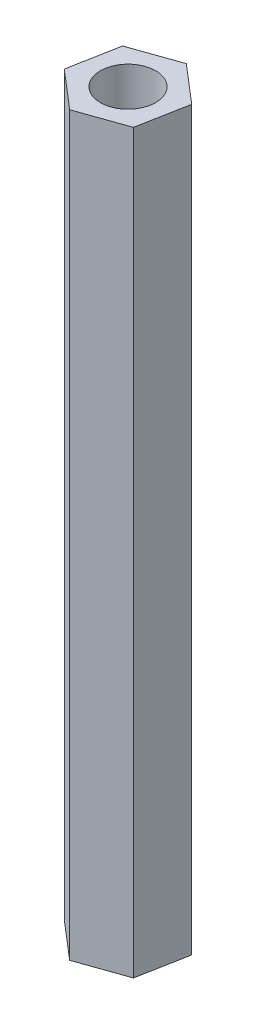
ISO-10303-21;
HEADER;
FILE_DESCRIPTION(('STEP AP214'),'2;1');
FILE_NAME('part.step','',(''),(''),'','','');
FILE_SCHEMA(('AUTOMOTIVE_DESIGN { 1 0 10303 214 1 1 1 1 }'));
ENDSEC;
DATA;
#1=APPLICATION_CONTEXT('core data for automotive mechanical design processes');
#2=APPLICATION_PROTOCOL_DEFINITION('international standard','automotive_design',2000,#1);
#3=PRODUCT_CONTEXT('',#1,'mechanical');
#4=PRODUCT('Part','Part','',(#3));
#5=PRODUCT_RELATED_PRODUCT_CATEGORY('part','',(#4));
#6=PRODUCT_DEFINITION_FORMATION('','',#4);
#7=PRODUCT_DEFINITION_CONTEXT('part definition',#1,'design');
#8=PRODUCT_DEFINITION('design','',#6,#7);
#9=PRODUCT_DEFINITION_SHAPE('','',#8);
#10=(LENGTH_UNIT() NAMED_UNIT(*) SI_UNIT(.MILLI.,.METRE.));
#11=(NAMED_UNIT(*) PLANE_ANGLE_UNIT() SI_UNIT($,.RADIAN.));
#12=(NAMED_UNIT(*) SI_UNIT($,.STERADIAN.) SOLID_ANGLE_UNIT());
#13=UNCERTAINTY_MEASURE_WITH_UNIT(LENGTH_MEASURE(1.E-05),#10,'distance_accuracy_value','');
#14=(GEOMETRIC_REPRESENTATION_CONTEXT(3) GLOBAL_UNCERTAINTY_ASSIGNED_CONTEXT((#13)) GLOBAL_UNIT_ASSIGNED_CONTEXT((#10,
#11,#12)) REPRESENTATION_CONTEXT('',''));
#15=CARTESIAN_POINT('',(0.,0.,0.));
#16=DIRECTION('',(0.,0.,1.));
#17=DIRECTION('',(1.,0.,0.));
#18=AXIS2_PLACEMENT_3D('',#15,#16,#17);
#19=CARTESIAN_POINT('',(0.,40.,0.));
#20=DIRECTION('',(0.,1.,0.));
#21=DIRECTION('',(0.,0.,1.));
#22=AXIS2_PLACEMENT_3D('',#19,#20,#21);
#23=PLANE('',#22);
#24=DIRECTION('',(0.943111141413518,0.,-0.332477630738807));
#25=VECTOR('',#24,1.);
#26=CARTESIAN_POINT('',(-0.498265425485253,40.,2.66740789889723));
#27=LINE('',#26,#25);
#28=CARTESIAN_POINT('',(-0.498265425485253,40.,2.66740789889723));
#29=VERTEX_POINT('',#28);
#30=CARTESIAN_POINT('',(2.06091028995765,40.,1.76521446574631));
#31=VERTEX_POINT('',#30);
#32=EDGE_CURVE('E135',#29,#31,#27,.T.);
#33=ORIENTED_EDGE('',*,*,#32,.T.);
#34=DIRECTION('',(0.18362149629689,0.,-0.982997022425649));
#35=VECTOR('',#34,1.);
#36=CARTESIAN_POINT('',(2.06091028995765,40.,1.76521446574631));
#37=LINE('',#36,#35);
#38=CARTESIAN_POINT('',(2.5591757154429,40.,-0.902193433150924));
#39=VERTEX_POINT('',#38);
#40=EDGE_CURVE('E93',#31,#39,#37,.T.);
#41=ORIENTED_EDGE('',*,*,#40,.T.);
#42=DIRECTION('',(-0.759489645116628,0.,-0.650519391686841));
#43=VECTOR('',#42,1.);
#44=CARTESIAN_POINT('',(2.5591757154429,40.,-0.902193433150924));
#45=LINE('',#44,#43);
#46=CARTESIAN_POINT('',(0.498265425485253,40.,-2.66740789889723));
#47=VERTEX_POINT('',#46);
#48=EDGE_CURVE('E106',#39,#47,#45,.T.);
#49=ORIENTED_EDGE('',*,*,#48,.T.);
#50=DIRECTION('',(-0.943111141413518,0.,0.332477630738807));
#51=VECTOR('',#50,1.);
#52=CARTESIAN_POINT('',(0.498265425485253,40.,-2.66740789889723));
#53=LINE('',#52,#51);
#54=CARTESIAN_POINT('',(-2.06091028995765,40.,-1.76521446574631));
#55=VERTEX_POINT('',#54);
#56=EDGE_CURVE('E100',#47,#55,#53,.T.);
#57=ORIENTED_EDGE('',*,*,#56,.T.);
#58=DIRECTION('',(-0.18362149629689,0.,0.982997022425649));
#59=VECTOR('',#58,1.);
#60=CARTESIAN_POINT('',(-2.06091028995765,40.,-1.76521446574631));
#61=LINE('',#60,#59);
#62=CARTESIAN_POINT('',(-2.5591757154429,40.,0.902193433150923));
#63=VERTEX_POINT('',#62);
#64=EDGE_CURVE('E104',#55,#63,#61,.T.);
#65=ORIENTED_EDGE('',*,*,#64,.T.);
#66=DIRECTION('',(0.759489645116628,0.,0.650519391686841));
#67=VECTOR('',#66,1.);
#68=CARTESIAN_POINT('',(-2.5591757154429,40.,0.902193433150923));
#69=LINE('',#68,#67);
#70=EDGE_CURVE('E56',#63,#29,#69,.T.);
#71=ORIENTED_EDGE('',*,*,#70,.T.);
#72=EDGE_LOOP('',(#33,#41,#49,#57,#65,#71));
#73=FACE_BOUND('',#72,.T.);
#74=CARTESIAN_POINT('',(0.,40.,0.));
#75=DIRECTION('',(0.,1.,0.));
#76=DIRECTION('',(0.,0.,1.));
#77=AXIS2_PLACEMENT_3D('',#74,#75,#76);
#78=CIRCLE('',#77,1.5);
#79=CARTESIAN_POINT('',(0.,40.,1.5));
#80=VERTEX_POINT('',#79);
#81=EDGE_CURVE('E128',#80,#80,#78,.T.);
#82=ORIENTED_EDGE('',*,*,#81,.F.);
#83=EDGE_LOOP('',(#82));
#84=FACE_BOUND('',#83,.T.);
#85=ADVANCED_FACE('F39',(#73,#84),#23,.T.);
#86=CARTESIAN_POINT('',(0.,0.,0.));
#87=DIRECTION('',(0.,1.,0.));
#88=DIRECTION('',(0.,0.,1.));
#89=AXIS2_PLACEMENT_3D('',#86,#87,#88);
#90=PLANE('',#89);
#91=DIRECTION('',(0.943111141413518,0.,-0.332477630738807));
#92=VECTOR('',#91,1.);
#93=CARTESIAN_POINT('',(-0.498265425485253,0.,2.66740789889723));
#94=LINE('',#93,#92);
#95=CARTESIAN_POINT('',(-0.498265425485253,0.,2.66740789889723));
#96=VERTEX_POINT('',#95);
#97=CARTESIAN_POINT('',(2.06091028995765,0.,1.76521446574631));
#98=VERTEX_POINT('',#97);
#99=EDGE_CURVE('E124',#96,#98,#94,.T.);
#100=ORIENTED_EDGE('',*,*,#99,.F.);
#101=DIRECTION('',(0.759489645116628,0.,0.650519391686841));
#102=VECTOR('',#101,1.);
#103=CARTESIAN_POINT('',(-2.5591757154429,0.,0.902193433150923));
#104=LINE('',#103,#102);
#105=CARTESIAN_POINT('',(-2.5591757154429,0.,0.902193433150923));
#106=VERTEX_POINT('',#105);
#107=EDGE_CURVE('E85',#106,#96,#104,.T.);
#108=ORIENTED_EDGE('',*,*,#107,.F.);
#109=DIRECTION('',(-0.18362149629689,0.,0.982997022425649));
#110=VECTOR('',#109,1.);
#111=CARTESIAN_POINT('',(-2.06091028995765,0.,-1.76521446574631));
#112=LINE('',#111,#110);
#113=CARTESIAN_POINT('',(-2.06091028995765,0.,-1.76521446574631));
#114=VERTEX_POINT('',#113);
#115=EDGE_CURVE('E79',#114,#106,#112,.T.);
#116=ORIENTED_EDGE('',*,*,#115,.F.);
#117=DIRECTION('',(-0.943111141413518,0.,0.332477630738807));
#118=VECTOR('',#117,1.);
#119=CARTESIAN_POINT('',(0.498265425485253,0.,-2.66740789889723));
#120=LINE('',#119,#118);
#121=CARTESIAN_POINT('',(0.498265425485253,0.,-2.66740789889723));
#122=VERTEX_POINT('',#121);
#123=EDGE_CURVE('E114',#122,#114,#120,.T.);
#124=ORIENTED_EDGE('',*,*,#123,.F.);
#125=DIRECTION('',(-0.759489645116628,0.,-0.650519391686841));
#126=VECTOR('',#125,1.);
#127=CARTESIAN_POINT('',(2.5591757154429,0.,-0.902193433150924));
#128=LINE('',#127,#126);
#129=CARTESIAN_POINT('',(2.5591757154429,0.,-0.902193433150924));
#130=VERTEX_POINT('',#129);
#131=EDGE_CURVE('E130',#130,#122,#128,.T.);
#132=ORIENTED_EDGE('',*,*,#131,.F.);
#133=DIRECTION('',(0.18362149629689,0.,-0.982997022425649));
#134=VECTOR('',#133,1.);
#135=CARTESIAN_POINT('',(2.06091028995765,0.,1.76521446574631));
#136=LINE('',#135,#134);
#137=EDGE_CURVE('E127',#98,#130,#136,.T.);
#138=ORIENTED_EDGE('',*,*,#137,.F.);
#139=EDGE_LOOP('',(#100,#108,#116,#124,#132,#138));
#140=FACE_BOUND('',#139,.T.);
#141=CARTESIAN_POINT('',(0.,0.,0.));
#142=DIRECTION('',(0.,1.,0.));
#143=DIRECTION('',(0.,0.,1.));
#144=AXIS2_PLACEMENT_3D('',#141,#142,#143);
#145=CIRCLE('',#144,1.5);
#146=CARTESIAN_POINT('',(0.,0.,1.5));
#147=VERTEX_POINT('',#146);
#148=EDGE_CURVE('E228',#147,#147,#145,.T.);
#149=ORIENTED_EDGE('',*,*,#148,.T.);
#150=EDGE_LOOP('',(#149));
#151=FACE_BOUND('',#150,.T.);
#152=ADVANCED_FACE('F144',(#140,#151),#90,.F.);
#153=CARTESIAN_POINT('',(-0.498265425485253,40.,2.66740789889723));
#154=DIRECTION('',(-0.332477630738807,0.,-0.943111141413518));
#155=DIRECTION('',(-0.943111141413519,0.,0.332477630738807));
#156=AXIS2_PLACEMENT_3D('',#153,#154,#155);
#157=PLANE('',#156);
#158=ORIENTED_EDGE('',*,*,#99,.T.);
#159=DIRECTION('',(0.,-1.,0.));
#160=VECTOR('',#159,1.);
#161=CARTESIAN_POINT('',(2.06091028995765,40.,1.76521446574631));
#162=LINE('',#161,#160);
#163=EDGE_CURVE('E11',#31,#98,#162,.T.);
#164=ORIENTED_EDGE('',*,*,#163,.F.);
#165=ORIENTED_EDGE('',*,*,#32,.F.);
#166=DIRECTION('',(0.,-1.,0.));
#167=VECTOR('',#166,1.);
#168=CARTESIAN_POINT('',(-0.498265425485253,40.,2.66740789889723));
#169=LINE('',#168,#167);
#170=EDGE_CURVE('E120',#29,#96,#169,.T.);
#171=ORIENTED_EDGE('',*,*,#170,.T.);
#172=EDGE_LOOP('',(#158,#164,#165,#171));
#173=FACE_BOUND('',#172,.T.);
#174=ADVANCED_FACE('F41',(#173),#157,.F.);
#175=CARTESIAN_POINT('',(2.06091028995765,40.,1.76521446574631));
#176=DIRECTION('',(-0.982997022425649,0.,-0.18362149629689));
#177=DIRECTION('',(-0.18362149629689,0.,0.982997022425649));
#178=AXIS2_PLACEMENT_3D('',#175,#176,#177);
#179=PLANE('',#178);
#180=ORIENTED_EDGE('',*,*,#137,.T.);
#181=DIRECTION('',(0.,-1.,0.));
#182=VECTOR('',#181,1.);
#183=CARTESIAN_POINT('',(2.5591757154429,40.,-0.902193433150924));
#184=LINE('',#183,#182);
#185=EDGE_CURVE('E48',#39,#130,#184,.T.);
#186=ORIENTED_EDGE('',*,*,#185,.F.);
#187=ORIENTED_EDGE('',*,*,#40,.F.);
#188=ORIENTED_EDGE('',*,*,#163,.T.);
#189=EDGE_LOOP('',(#180,#186,#187,#188));
#190=FACE_BOUND('',#189,.T.);
#191=ADVANCED_FACE('F169',(#190),#179,.F.);
#192=CARTESIAN_POINT('',(2.5591757154429,40.,-0.902193433150924));
#193=DIRECTION('',(-0.650519391686841,0.,0.759489645116628));
#194=DIRECTION('',(0.759489645116628,0.,0.650519391686841));
#195=AXIS2_PLACEMENT_3D('',#192,#193,#194);
#196=PLANE('',#195);
#197=ORIENTED_EDGE('',*,*,#131,.T.);
#198=DIRECTION('',(0.,-1.,0.));
#199=VECTOR('',#198,1.);
#200=CARTESIAN_POINT('',(0.498265425485253,40.,-2.66740789889723));
#201=LINE('',#200,#199);
#202=EDGE_CURVE('E115',#47,#122,#201,.T.);
#203=ORIENTED_EDGE('',*,*,#202,.F.);
#204=ORIENTED_EDGE('',*,*,#48,.F.);
#205=ORIENTED_EDGE('',*,*,#185,.T.);
#206=EDGE_LOOP('',(#197,#203,#204,#205));
#207=FACE_BOUND('',#206,.T.);
#208=ADVANCED_FACE('F141',(#207),#196,.F.);
#209=CARTESIAN_POINT('',(0.498265425485253,40.,-2.66740789889723));
#210=DIRECTION('',(0.332477630738807,0.,0.943111141413518));
#211=DIRECTION('',(0.943111141413518,0.,-0.332477630738807));
#212=AXIS2_PLACEMENT_3D('',#209,#210,#211);
#213=PLANE('',#212);
#214=ORIENTED_EDGE('',*,*,#123,.T.);
#215=DIRECTION('',(0.,-1.,0.));
#216=VECTOR('',#215,1.);
#217=CARTESIAN_POINT('',(-2.06091028995765,40.,-1.76521446574631));
#218=LINE('',#217,#216);
#219=EDGE_CURVE('E111',#55,#114,#218,.T.);
#220=ORIENTED_EDGE('',*,*,#219,.F.);
#221=ORIENTED_EDGE('',*,*,#56,.F.);
#222=ORIENTED_EDGE('',*,*,#202,.T.);
#223=EDGE_LOOP('',(#214,#220,#221,#222));
#224=FACE_BOUND('',#223,.T.);
#225=ADVANCED_FACE('F112',(#224),#213,.F.);
#226=CARTESIAN_POINT('',(-2.06091028995765,40.,-1.76521446574631));
#227=DIRECTION('',(0.982997022425649,0.,0.18362149629689));
#228=DIRECTION('',(0.18362149629689,0.,-0.982997022425649));
#229=AXIS2_PLACEMENT_3D('',#226,#227,#228);
#230=PLANE('',#229);
#231=ORIENTED_EDGE('',*,*,#115,.T.);
#232=DIRECTION('',(0.,-1.,0.));
#233=VECTOR('',#232,1.);
#234=CARTESIAN_POINT('',(-2.5591757154429,40.,0.902193433150923));
#235=LINE('',#234,#233);
#236=EDGE_CURVE('E116',#63,#106,#235,.T.);
#237=ORIENTED_EDGE('',*,*,#236,.F.);
#238=ORIENTED_EDGE('',*,*,#64,.F.);
#239=ORIENTED_EDGE('',*,*,#219,.T.);
#240=EDGE_LOOP('',(#231,#237,#238,#239));
#241=FACE_BOUND('',#240,.T.);
#242=ADVANCED_FACE('F118',(#241),#230,.F.);
#243=CARTESIAN_POINT('',(-2.5591757154429,40.,0.902193433150923));
#244=DIRECTION('',(0.650519391686841,0.,-0.759489645116629));
#245=DIRECTION('',(-0.759489645116629,0.,-0.650519391686841));
#246=AXIS2_PLACEMENT_3D('',#243,#244,#245);
#247=PLANE('',#246);
#248=ORIENTED_EDGE('',*,*,#107,.T.);
#249=ORIENTED_EDGE('',*,*,#170,.F.);
#250=ORIENTED_EDGE('',*,*,#70,.F.);
#251=ORIENTED_EDGE('',*,*,#236,.T.);
#252=EDGE_LOOP('',(#248,#249,#250,#251));
#253=FACE_BOUND('',#252,.T.);
#254=ADVANCED_FACE('F149',(#253),#247,.F.);
#255=CARTESIAN_POINT('',(0.,40.,0.));
#256=DIRECTION('',(0.,-1.,0.));
#257=DIRECTION('',(0.,0.,-1.));
#258=AXIS2_PLACEMENT_3D('',#255,#256,#257);
#259=CYLINDRICAL_SURFACE('',#258,1.5);
#260=ORIENTED_EDGE('',*,*,#81,.T.);
#261=EDGE_LOOP('',(#260));
#262=FACE_BOUND('',#261,.T.);
#263=ORIENTED_EDGE('',*,*,#148,.F.);
#264=EDGE_LOOP('',(#263));
#265=FACE_BOUND('',#264,.T.);
#266=ADVANCED_FACE('F151',(#262,#265),#259,.F.);
#267=CLOSED_SHELL('',(#85,#152,#174,#191,#208,#225,#242,#254,#266));
#268=MANIFOLD_SOLID_BREP('B2',#267);
#269=ADVANCED_BREP_SHAPE_REPRESENTATION('',(#18,#268),#14);
#270=SHAPE_DEFINITION_REPRESENTATION(#9,#269);
ENDSEC;
END-ISO-10303-21;
